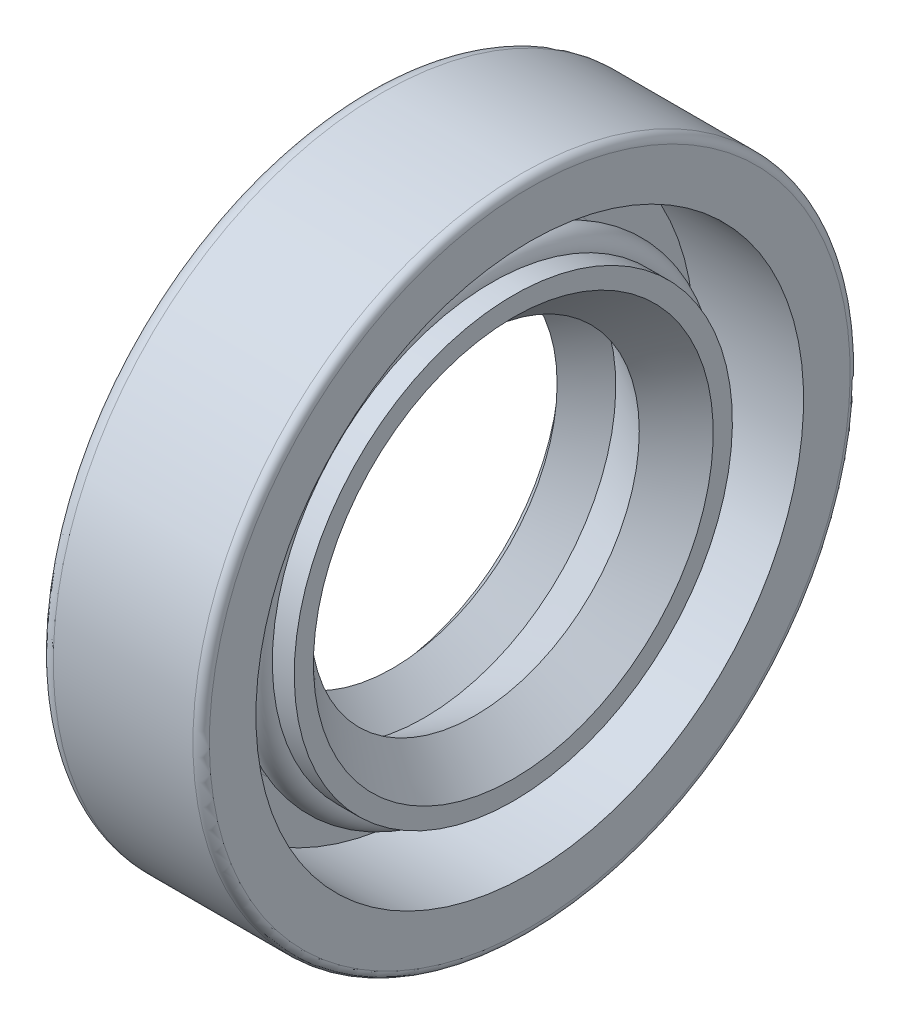
ISO-10303-21;
HEADER;
FILE_DESCRIPTION(('STEP AP214'),'2;1');
FILE_NAME('part.step','',(''),(''),'','','');
FILE_SCHEMA(('AUTOMOTIVE_DESIGN { 1 0 10303 214 1 1 1 1 }'));
ENDSEC;
DATA;
#1=APPLICATION_CONTEXT('core data for automotive mechanical design processes');
#2=APPLICATION_PROTOCOL_DEFINITION('international standard','automotive_design',2000,#1);
#3=PRODUCT_CONTEXT('',#1,'mechanical');
#4=PRODUCT('Part','Part','',(#3));
#5=PRODUCT_RELATED_PRODUCT_CATEGORY('part','',(#4));
#6=PRODUCT_DEFINITION_FORMATION('','',#4);
#7=PRODUCT_DEFINITION_CONTEXT('part definition',#1,'design');
#8=PRODUCT_DEFINITION('design','',#6,#7);
#9=PRODUCT_DEFINITION_SHAPE('','',#8);
#10=(LENGTH_UNIT() NAMED_UNIT(*) SI_UNIT(.MILLI.,.METRE.));
#11=(NAMED_UNIT(*) PLANE_ANGLE_UNIT() SI_UNIT($,.RADIAN.));
#12=(NAMED_UNIT(*) SI_UNIT($,.STERADIAN.) SOLID_ANGLE_UNIT());
#13=UNCERTAINTY_MEASURE_WITH_UNIT(LENGTH_MEASURE(1.E-05),#10,'distance_accuracy_value','');
#14=(GEOMETRIC_REPRESENTATION_CONTEXT(3) GLOBAL_UNCERTAINTY_ASSIGNED_CONTEXT((#13)) GLOBAL_UNIT_ASSIGNED_CONTEXT((#10,
#11,#12)) REPRESENTATION_CONTEXT('',''));
#15=CARTESIAN_POINT('',(0.,0.,0.));
#16=DIRECTION('',(0.,0.,1.));
#17=DIRECTION('',(1.,0.,0.));
#18=AXIS2_PLACEMENT_3D('',#15,#16,#17);
#19=CARTESIAN_POINT('',(4.23333333333333,0.,0.));
#20=DIRECTION('',(-1.,0.,0.));
#21=DIRECTION('',(0.,0.,1.));
#22=AXIS2_PLACEMENT_3D('',#19,#20,#21);
#23=TOROIDAL_SURFACE('',#22,8.46666666666667,0.635);
#24=CARTESIAN_POINT('',(4.23333333333333,0.,9.10166666666667));
#25=VERTEX_POINT('',#24);
#26=VERTEX_LOOP('',#25);
#27=FACE_BOUND('',#26,.T.);
#28=ADVANCED_FACE('F43',(#27),#23,.T.);
#29=CLOSED_SHELL('',(#28));
#30=MANIFOLD_SOLID_BREP('B2',#29);
#31=CARTESIAN_POINT('',(0.,12.065,0.));
#32=DIRECTION('',(1.,0.,0.));
#33=DIRECTION('',(0.,1.,0.));
#34=AXIS2_PLACEMENT_3D('',#31,#32,#33);
#35=PLANE('',#34);
#36=CARTESIAN_POINT('',(0.,0.,0.));
#37=DIRECTION('',(-1.,0.,0.));
#38=DIRECTION('',(0.,-1.,0.));
#39=AXIS2_PLACEMENT_3D('',#36,#37,#38);
#40=CIRCLE('',#39,10.5833333333333);
#41=CARTESIAN_POINT('',(0.,-10.5833333333333,0.));
#42=VERTEX_POINT('',#41);
#43=EDGE_CURVE('E42',#42,#42,#40,.T.);
#44=ORIENTED_EDGE('',*,*,#43,.F.);
#45=EDGE_LOOP('',(#44));
#46=FACE_BOUND('',#45,.T.);
#47=CARTESIAN_POINT('',(0.,0.,0.));
#48=DIRECTION('',(-1.,0.,0.));
#49=DIRECTION('',(0.,-1.,0.));
#50=AXIS2_PLACEMENT_3D('',#47,#48,#49);
#51=CIRCLE('',#50,12.065);
#52=CARTESIAN_POINT('',(0.,-12.065,0.));
#53=VERTEX_POINT('',#52);
#54=EDGE_CURVE('E124',#53,#53,#51,.T.);
#55=ORIENTED_EDGE('',*,*,#54,.T.);
#56=EDGE_LOOP('',(#55));
#57=FACE_BOUND('',#56,.T.);
#58=ADVANCED_FACE('F54',(#46,#57),#35,.F.);
#59=CARTESIAN_POINT('',(6.35,0.,0.));
#60=DIRECTION('',(-1.,0.,0.));
#61=DIRECTION('',(0.,-1.,0.));
#62=AXIS2_PLACEMENT_3D('',#59,#60,#61);
#63=CYLINDRICAL_SURFACE('',#62,10.5833333333333);
#64=CARTESIAN_POINT('',(0.1984375,0.,0.));
#65=DIRECTION('',(-1.,0.,0.));
#66=DIRECTION('',(0.,-1.,0.));
#67=AXIS2_PLACEMENT_3D('',#64,#65,#66);
#68=CIRCLE('',#67,10.5833333333333);
#69=CARTESIAN_POINT('',(0.1984375,-10.5833333333333,0.));
#70=VERTEX_POINT('',#69);
#71=EDGE_CURVE('E60',#70,#70,#68,.T.);
#72=ORIENTED_EDGE('',*,*,#71,.F.);
#73=EDGE_LOOP('',(#72));
#74=FACE_BOUND('',#73,.T.);
#75=ORIENTED_EDGE('',*,*,#43,.T.);
#76=EDGE_LOOP('',(#75));
#77=FACE_BOUND('',#76,.T.);
#78=ADVANCED_FACE('F245',(#74,#77),#63,.F.);
#79=CARTESIAN_POINT('',(0.1984375,10.5833333333333,0.));
#80=DIRECTION('',(1.,0.,0.));
#81=DIRECTION('',(0.,1.,0.));
#82=AXIS2_PLACEMENT_3D('',#79,#80,#81);
#83=PLANE('',#82);
#84=CARTESIAN_POINT('',(0.198437500000001,0.,0.));
#85=DIRECTION('',(-1.,0.,0.));
#86=DIRECTION('',(0.,-1.,0.));
#87=AXIS2_PLACEMENT_3D('',#84,#85,#86);
#88=CIRCLE('',#87,8.46666666666667);
#89=CARTESIAN_POINT('',(0.198437500000001,-8.46666666666667,0.));
#90=VERTEX_POINT('',#89);
#91=EDGE_CURVE('E64',#90,#90,#88,.T.);
#92=ORIENTED_EDGE('',*,*,#91,.F.);
#93=EDGE_LOOP('',(#92));
#94=FACE_BOUND('',#93,.T.);
#95=ORIENTED_EDGE('',*,*,#71,.T.);
#96=EDGE_LOOP('',(#95));
#97=FACE_BOUND('',#96,.T.);
#98=ADVANCED_FACE('F240',(#94,#97),#83,.F.);
#99=CARTESIAN_POINT('',(6.35,0.,0.));
#100=DIRECTION('',(-1.,0.,0.));
#101=DIRECTION('',(0.,-1.,0.));
#102=AXIS2_PLACEMENT_3D('',#99,#100,#101);
#103=CYLINDRICAL_SURFACE('',#102,8.46666666666667);
#104=CARTESIAN_POINT('',(0.,0.,0.));
#105=DIRECTION('',(-1.,0.,0.));
#106=DIRECTION('',(0.,-1.,0.));
#107=AXIS2_PLACEMENT_3D('',#104,#105,#106);
#108=CIRCLE('',#107,8.46666666666667);
#109=CARTESIAN_POINT('',(0.,-8.46666666666667,0.));
#110=VERTEX_POINT('',#109);
#111=EDGE_CURVE('E68',#110,#110,#108,.T.);
#112=ORIENTED_EDGE('',*,*,#111,.F.);
#113=EDGE_LOOP('',(#112));
#114=FACE_BOUND('',#113,.T.);
#115=ORIENTED_EDGE('',*,*,#91,.T.);
#116=EDGE_LOOP('',(#115));
#117=FACE_BOUND('',#116,.T.);
#118=ADVANCED_FACE('F234',(#114,#117),#103,.T.);
#119=CARTESIAN_POINT('',(0.,8.46666666666667,0.));
#120=DIRECTION('',(1.,0.,0.));
#121=DIRECTION('',(0.,1.,0.));
#122=AXIS2_PLACEMENT_3D('',#119,#120,#121);
#123=PLANE('',#122);
#124=CARTESIAN_POINT('',(0.,0.,0.));
#125=DIRECTION('',(-1.,0.,0.));
#126=DIRECTION('',(0.,-1.,0.));
#127=AXIS2_PLACEMENT_3D('',#124,#125,#126);
#128=CIRCLE('',#127,7.9375);
#129=CARTESIAN_POINT('',(0.,-7.9375,0.));
#130=VERTEX_POINT('',#129);
#131=EDGE_CURVE('E73',#130,#130,#128,.T.);
#132=ORIENTED_EDGE('',*,*,#131,.F.);
#133=EDGE_LOOP('',(#132));
#134=FACE_BOUND('',#133,.T.);
#135=ORIENTED_EDGE('',*,*,#111,.T.);
#136=EDGE_LOOP('',(#135));
#137=FACE_BOUND('',#136,.T.);
#138=ADVANCED_FACE('F228',(#134,#137),#123,.F.);
#139=CARTESIAN_POINT('',(0.,0.,0.));
#140=DIRECTION('',(-1.,0.,0.));
#141=DIRECTION('',(0.,-1.,0.));
#142=AXIS2_PLACEMENT_3D('',#139,#140,#141);
#143=CONICAL_SURFACE('',#142,7.9375,0.463647609000807);
#144=CARTESIAN_POINT('',(1.05833333333333,0.,0.));
#145=DIRECTION('',(-1.,0.,0.));
#146=DIRECTION('',(0.,-1.,0.));
#147=AXIS2_PLACEMENT_3D('',#144,#145,#146);
#148=CIRCLE('',#147,7.40833333333334);
#149=CARTESIAN_POINT('',(1.05833333333333,-7.40833333333334,0.));
#150=VERTEX_POINT('',#149);
#151=EDGE_CURVE('E76',#150,#150,#148,.T.);
#152=ORIENTED_EDGE('',*,*,#151,.F.);
#153=EDGE_LOOP('',(#152));
#154=FACE_BOUND('',#153,.T.);
#155=ORIENTED_EDGE('',*,*,#131,.T.);
#156=EDGE_LOOP('',(#155));
#157=FACE_BOUND('',#156,.T.);
#158=ADVANCED_FACE('F222',(#154,#157),#143,.F.);
#159=CARTESIAN_POINT('',(1.05833333333333,0.,0.));
#160=DIRECTION('',(1.,0.,0.));
#161=DIRECTION('',(0.,1.,0.));
#162=AXIS2_PLACEMENT_3D('',#159,#160,#161);
#163=CONICAL_SURFACE('',#162,7.40833333333334,0.719400653671796);
#164=CARTESIAN_POINT('',(0.533769729812629,0.,0.));
#165=DIRECTION('',(-1.,0.,0.));
#166=DIRECTION('',(0.,-1.,0.));
#167=AXIS2_PLACEMENT_3D('',#164,#165,#166);
#168=CIRCLE('',#167,6.94881138629771);
#169=CARTESIAN_POINT('',(0.533769729812629,-6.94881138629771,0.));
#170=VERTEX_POINT('',#169);
#171=EDGE_CURVE('E79',#170,#170,#168,.T.);
#172=ORIENTED_EDGE('',*,*,#171,.F.);
#173=EDGE_LOOP('',(#172));
#174=FACE_BOUND('',#173,.T.);
#175=ORIENTED_EDGE('',*,*,#151,.T.);
#176=EDGE_LOOP('',(#175));
#177=FACE_BOUND('',#176,.T.);
#178=ADVANCED_FACE('F216',(#174,#177),#163,.T.);
#179=CARTESIAN_POINT('',(0.533769729812629,0.,0.));
#180=DIRECTION('',(-1.,0.,0.));
#181=DIRECTION('',(0.,-1.,0.));
#182=AXIS2_PLACEMENT_3D('',#179,#180,#181);
#183=CONICAL_SURFACE('',#182,6.94881138629771,0.851395673123101);
#184=CARTESIAN_POINT('',(1.05833333333333,0.,0.));
#185=DIRECTION('',(-1.,0.,0.));
#186=DIRECTION('',(0.,-1.,0.));
#187=AXIS2_PLACEMENT_3D('',#184,#185,#186);
#188=CIRCLE('',#187,6.35);
#189=CARTESIAN_POINT('',(1.05833333333333,-6.35,0.));
#190=VERTEX_POINT('',#189);
#191=EDGE_CURVE('E82',#190,#190,#188,.T.);
#192=ORIENTED_EDGE('',*,*,#191,.F.);
#193=EDGE_LOOP('',(#192));
#194=FACE_BOUND('',#193,.T.);
#195=ORIENTED_EDGE('',*,*,#171,.T.);
#196=EDGE_LOOP('',(#195));
#197=FACE_BOUND('',#196,.T.);
#198=ADVANCED_FACE('F210',(#194,#197),#183,.F.);
#199=CARTESIAN_POINT('',(1.05833333333333,0.,0.));
#200=DIRECTION('',(1.,0.,0.));
#201=DIRECTION('',(0.,1.,0.));
#202=AXIS2_PLACEMENT_3D('',#199,#200,#201);
#203=CONICAL_SURFACE('',#202,6.35,0.719400653671796);
#204=CARTESIAN_POINT('',(2.26646528576948,0.,0.));
#205=DIRECTION('',(-1.,0.,0.));
#206=DIRECTION('',(0.,-1.,0.));
#207=AXIS2_PLACEMENT_3D('',#204,#205,#206);
#208=CIRCLE('',#207,7.40833333333334);
#209=CARTESIAN_POINT('',(2.26646528576948,-7.40833333333334,0.));
#210=VERTEX_POINT('',#209);
#211=EDGE_CURVE('E85',#210,#210,#208,.T.);
#212=ORIENTED_EDGE('',*,*,#211,.F.);
#213=EDGE_LOOP('',(#212));
#214=FACE_BOUND('',#213,.T.);
#215=ORIENTED_EDGE('',*,*,#191,.T.);
#216=EDGE_LOOP('',(#215));
#217=FACE_BOUND('',#216,.T.);
#218=ADVANCED_FACE('F204',(#214,#217),#203,.F.);
#219=CARTESIAN_POINT('',(2.26646528576948,0.,0.));
#220=DIRECTION('',(-1.,0.,0.));
#221=DIRECTION('',(0.,-1.,0.));
#222=AXIS2_PLACEMENT_3D('',#219,#220,#221);
#223=CONICAL_SURFACE('',#222,7.40833333333334,0.493645926133372);
#224=CARTESIAN_POINT('',(4.23333333333333,0.,0.));
#225=DIRECTION('',(-1.,0.,0.));
#226=DIRECTION('',(0.,-1.,0.));
#227=AXIS2_PLACEMENT_3D('',#224,#225,#226);
#228=CIRCLE('',#227,6.35);
#229=CARTESIAN_POINT('',(4.23333333333333,-6.35,0.));
#230=VERTEX_POINT('',#229);
#231=EDGE_CURVE('E88',#230,#230,#228,.T.);
#232=ORIENTED_EDGE('',*,*,#231,.F.);
#233=EDGE_LOOP('',(#232));
#234=FACE_BOUND('',#233,.T.);
#235=ORIENTED_EDGE('',*,*,#211,.T.);
#236=EDGE_LOOP('',(#235));
#237=FACE_BOUND('',#236,.T.);
#238=ADVANCED_FACE('F198',(#234,#237),#223,.F.);
#239=CARTESIAN_POINT('',(4.23333333333333,0.,0.));
#240=DIRECTION('',(1.,0.,0.));
#241=DIRECTION('',(0.,1.,0.));
#242=AXIS2_PLACEMENT_3D('',#239,#240,#241);
#243=CONICAL_SURFACE('',#242,6.35,0.748378047523382);
#244=CARTESIAN_POINT('',(5.71500000000001,0.,0.));
#245=DIRECTION('',(-1.,0.,0.));
#246=DIRECTION('',(0.,-1.,0.));
#247=AXIS2_PLACEMENT_3D('',#244,#245,#246);
#248=CIRCLE('',#247,7.72583333333297);
#249=CARTESIAN_POINT('',(5.71500000000001,-7.72583333333297,0.));
#250=VERTEX_POINT('',#249);
#251=EDGE_CURVE('E91',#250,#250,#248,.T.);
#252=ORIENTED_EDGE('',*,*,#251,.F.);
#253=EDGE_LOOP('',(#252));
#254=FACE_BOUND('',#253,.T.);
#255=ORIENTED_EDGE('',*,*,#231,.T.);
#256=EDGE_LOOP('',(#255));
#257=FACE_BOUND('',#256,.T.);
#258=ADVANCED_FACE('F192',(#254,#257),#243,.F.);
#259=CARTESIAN_POINT('',(5.71500000000001,7.72583333333297,0.));
#260=DIRECTION('',(-1.,0.,0.));
#261=DIRECTION('',(0.,-1.,0.));
#262=AXIS2_PLACEMENT_3D('',#259,#260,#261);
#263=PLANE('',#262);
#264=CARTESIAN_POINT('',(5.71500000000001,0.,0.));
#265=DIRECTION('',(-1.,0.,0.));
#266=DIRECTION('',(0.,-1.,0.));
#267=AXIS2_PLACEMENT_3D('',#264,#265,#266);
#268=CIRCLE('',#267,8.46666666666667);
#269=CARTESIAN_POINT('',(5.71500000000001,-8.46666666666667,0.));
#270=VERTEX_POINT('',#269);
#271=EDGE_CURVE('E94',#270,#270,#268,.T.);
#272=ORIENTED_EDGE('',*,*,#271,.F.);
#273=EDGE_LOOP('',(#272));
#274=FACE_BOUND('',#273,.T.);
#275=ORIENTED_EDGE('',*,*,#251,.T.);
#276=EDGE_LOOP('',(#275));
#277=FACE_BOUND('',#276,.T.);
#278=ADVANCED_FACE('F186',(#274,#277),#263,.F.);
#279=CARTESIAN_POINT('',(6.35,0.,0.));
#280=DIRECTION('',(-1.,0.,0.));
#281=DIRECTION('',(0.,-1.,0.));
#282=AXIS2_PLACEMENT_3D('',#279,#280,#281);
#283=CYLINDRICAL_SURFACE('',#282,8.46666666666667);
#284=CARTESIAN_POINT('',(4.86833333333333,0.,0.));
#285=DIRECTION('',(-1.,0.,0.));
#286=DIRECTION('',(0.,-1.,0.));
#287=AXIS2_PLACEMENT_3D('',#284,#285,#286);
#288=CIRCLE('',#287,8.46666666666667);
#289=CARTESIAN_POINT('',(4.86833333333333,-8.46666666666667,0.));
#290=VERTEX_POINT('',#289);
#291=EDGE_CURVE('E97',#290,#290,#288,.T.);
#292=ORIENTED_EDGE('',*,*,#291,.F.);
#293=EDGE_LOOP('',(#292));
#294=FACE_BOUND('',#293,.T.);
#295=ORIENTED_EDGE('',*,*,#271,.T.);
#296=EDGE_LOOP('',(#295));
#297=FACE_BOUND('',#296,.T.);
#298=ADVANCED_FACE('F180',(#294,#297),#283,.T.);
#299=CARTESIAN_POINT('',(4.23333333333333,0.,0.));
#300=DIRECTION('',(-1.,0.,0.));
#301=DIRECTION('',(0.,-1.,0.));
#302=AXIS2_PLACEMENT_3D('',#299,#300,#301);
#303=TOROIDAL_SURFACE('',#302,8.46666666666667,0.634999999999995);
#304=CARTESIAN_POINT('',(3.59833333333334,0.,0.));
#305=DIRECTION('',(-1.,0.,0.));
#306=DIRECTION('',(0.,-1.,0.));
#307=AXIS2_PLACEMENT_3D('',#304,#305,#306);
#308=CIRCLE('',#307,8.46666666666667);
#309=CARTESIAN_POINT('',(3.59833333333334,-8.46666666666667,0.));
#310=VERTEX_POINT('',#309);
#311=EDGE_CURVE('E100',#310,#310,#308,.T.);
#312=ORIENTED_EDGE('',*,*,#311,.F.);
#313=EDGE_LOOP('',(#312));
#314=FACE_BOUND('',#313,.T.);
#315=ORIENTED_EDGE('',*,*,#291,.T.);
#316=EDGE_LOOP('',(#315));
#317=FACE_BOUND('',#316,.T.);
#318=ADVANCED_FACE('F174',(#314,#317),#303,.F.);
#319=CARTESIAN_POINT('',(6.35,0.,0.));
#320=DIRECTION('',(-1.,0.,0.));
#321=DIRECTION('',(0.,-1.,0.));
#322=AXIS2_PLACEMENT_3D('',#319,#320,#321);
#323=CYLINDRICAL_SURFACE('',#322,8.46666666666667);
#324=CARTESIAN_POINT('',(2.43416666666667,0.,0.));
#325=DIRECTION('',(-1.,0.,0.));
#326=DIRECTION('',(0.,-1.,0.));
#327=AXIS2_PLACEMENT_3D('',#324,#325,#326);
#328=CIRCLE('',#327,8.46666666666667);
#329=CARTESIAN_POINT('',(2.43416666666667,-8.46666666666667,0.));
#330=VERTEX_POINT('',#329);
#331=EDGE_CURVE('E103',#330,#330,#328,.T.);
#332=ORIENTED_EDGE('',*,*,#331,.F.);
#333=EDGE_LOOP('',(#332));
#334=FACE_BOUND('',#333,.T.);
#335=ORIENTED_EDGE('',*,*,#311,.T.);
#336=EDGE_LOOP('',(#335));
#337=FACE_BOUND('',#336,.T.);
#338=ADVANCED_FACE('F168',(#334,#337),#323,.T.);
#339=CARTESIAN_POINT('',(2.43416666666667,0.,0.));
#340=DIRECTION('',(-1.,0.,0.));
#341=DIRECTION('',(0.,-1.,0.));
#342=AXIS2_PLACEMENT_3D('',#339,#340,#341);
#343=TOROIDAL_SURFACE('',#342,8.78416666666667,0.317500000000002);
#344=CARTESIAN_POINT('',(2.11666666666667,0.,0.));
#345=DIRECTION('',(-1.,0.,0.));
#346=DIRECTION('',(0.,-1.,0.));
#347=AXIS2_PLACEMENT_3D('',#344,#345,#346);
#348=CIRCLE('',#347,8.78416666666667);
#349=CARTESIAN_POINT('',(2.11666666666667,-8.78416666666667,0.));
#350=VERTEX_POINT('',#349);
#351=EDGE_CURVE('E106',#350,#350,#348,.T.);
#352=ORIENTED_EDGE('',*,*,#351,.F.);
#353=EDGE_LOOP('',(#352));
#354=FACE_BOUND('',#353,.T.);
#355=ORIENTED_EDGE('',*,*,#331,.T.);
#356=EDGE_LOOP('',(#355));
#357=FACE_BOUND('',#356,.T.);
#358=ADVANCED_FACE('F162',(#354,#357),#343,.F.);
#359=CARTESIAN_POINT('',(2.11666666666667,8.78416666666667,0.));
#360=DIRECTION('',(-1.,0.,0.));
#361=DIRECTION('',(0.,-1.,0.));
#362=AXIS2_PLACEMENT_3D('',#359,#360,#361);
#363=PLANE('',#362);
#364=CARTESIAN_POINT('',(2.11666666666667,0.,0.));
#365=DIRECTION('',(-1.,0.,0.));
#366=DIRECTION('',(0.,-1.,0.));
#367=AXIS2_PLACEMENT_3D('',#364,#365,#366);
#368=CIRCLE('',#367,10.5833333333333);
#369=CARTESIAN_POINT('',(2.11666666666667,-10.5833333333333,0.));
#370=VERTEX_POINT('',#369);
#371=EDGE_CURVE('E109',#370,#370,#368,.T.);
#372=ORIENTED_EDGE('',*,*,#371,.F.);
#373=EDGE_LOOP('',(#372));
#374=FACE_BOUND('',#373,.T.);
#375=ORIENTED_EDGE('',*,*,#351,.T.);
#376=EDGE_LOOP('',(#375));
#377=FACE_BOUND('',#376,.T.);
#378=ADVANCED_FACE('F156',(#374,#377),#363,.F.);
#379=CARTESIAN_POINT('',(6.35,0.,0.));
#380=DIRECTION('',(-1.,0.,0.));
#381=DIRECTION('',(0.,-1.,0.));
#382=AXIS2_PLACEMENT_3D('',#379,#380,#381);
#383=CYLINDRICAL_SURFACE('',#382,10.5833333333333);
#384=CARTESIAN_POINT('',(6.35,0.,0.));
#385=DIRECTION('',(-1.,0.,0.));
#386=DIRECTION('',(0.,-1.,0.));
#387=AXIS2_PLACEMENT_3D('',#384,#385,#386);
#388=CIRCLE('',#387,10.5833333333333);
#389=CARTESIAN_POINT('',(6.35,-10.5833333333333,0.));
#390=VERTEX_POINT('',#389);
#391=EDGE_CURVE('E112',#390,#390,#388,.T.);
#392=ORIENTED_EDGE('',*,*,#391,.F.);
#393=EDGE_LOOP('',(#392));
#394=FACE_BOUND('',#393,.T.);
#395=ORIENTED_EDGE('',*,*,#371,.T.);
#396=EDGE_LOOP('',(#395));
#397=FACE_BOUND('',#396,.T.);
#398=ADVANCED_FACE('F150',(#394,#397),#383,.F.);
#399=CARTESIAN_POINT('',(6.35,10.5833333333333,0.));
#400=DIRECTION('',(-1.,0.,0.));
#401=DIRECTION('',(0.,-1.,0.));
#402=AXIS2_PLACEMENT_3D('',#399,#400,#401);
#403=PLANE('',#402);
#404=CARTESIAN_POINT('',(6.35,0.,0.));
#405=DIRECTION('',(-1.,0.,0.));
#406=DIRECTION('',(0.,-1.,0.));
#407=AXIS2_PLACEMENT_3D('',#404,#405,#406);
#408=CIRCLE('',#407,12.3825);
#409=CARTESIAN_POINT('',(6.35,-12.3825,0.));
#410=VERTEX_POINT('',#409);
#411=EDGE_CURVE('E115',#410,#410,#408,.T.);
#412=ORIENTED_EDGE('',*,*,#411,.F.);
#413=EDGE_LOOP('',(#412));
#414=FACE_BOUND('',#413,.T.);
#415=ORIENTED_EDGE('',*,*,#391,.T.);
#416=EDGE_LOOP('',(#415));
#417=FACE_BOUND('',#416,.T.);
#418=ADVANCED_FACE('F144',(#414,#417),#403,.F.);
#419=CARTESIAN_POINT('',(6.0325,0.,0.));
#420=DIRECTION('',(-1.,0.,0.));
#421=DIRECTION('',(0.,-1.,0.));
#422=AXIS2_PLACEMENT_3D('',#419,#420,#421);
#423=TOROIDAL_SURFACE('',#422,12.3825,0.317499999999993);
#424=CARTESIAN_POINT('',(6.0325,0.,0.));
#425=DIRECTION('',(-1.,0.,0.));
#426=DIRECTION('',(0.,-1.,0.));
#427=AXIS2_PLACEMENT_3D('',#424,#425,#426);
#428=CIRCLE('',#427,12.7);
#429=CARTESIAN_POINT('',(6.0325,-12.7,0.));
#430=VERTEX_POINT('',#429);
#431=EDGE_CURVE('E118',#430,#430,#428,.T.);
#432=ORIENTED_EDGE('',*,*,#431,.F.);
#433=EDGE_LOOP('',(#432));
#434=FACE_BOUND('',#433,.T.);
#435=ORIENTED_EDGE('',*,*,#411,.T.);
#436=EDGE_LOOP('',(#435));
#437=FACE_BOUND('',#436,.T.);
#438=ADVANCED_FACE('F138',(#434,#437),#423,.T.);
#439=CARTESIAN_POINT('',(6.35,0.,0.));
#440=DIRECTION('',(-1.,0.,0.));
#441=DIRECTION('',(0.,-1.,0.));
#442=AXIS2_PLACEMENT_3D('',#439,#440,#441);
#443=CYLINDRICAL_SURFACE('',#442,12.7);
#444=CARTESIAN_POINT('',(0.634999999999989,0.,0.));
#445=DIRECTION('',(-1.,0.,0.));
#446=DIRECTION('',(0.,-1.,0.));
#447=AXIS2_PLACEMENT_3D('',#444,#445,#446);
#448=CIRCLE('',#447,12.7);
#449=CARTESIAN_POINT('',(0.634999999999989,-12.7,0.));
#450=VERTEX_POINT('',#449);
#451=EDGE_CURVE('E121',#450,#450,#448,.T.);
#452=ORIENTED_EDGE('',*,*,#451,.F.);
#453=EDGE_LOOP('',(#452));
#454=FACE_BOUND('',#453,.T.);
#455=ORIENTED_EDGE('',*,*,#431,.T.);
#456=EDGE_LOOP('',(#455));
#457=FACE_BOUND('',#456,.T.);
#458=ADVANCED_FACE('F132',(#454,#457),#443,.T.);
#459=CARTESIAN_POINT('',(0.634999999999989,0.,0.));
#460=DIRECTION('',(-1.,0.,0.));
#461=DIRECTION('',(0.,-1.,0.));
#462=AXIS2_PLACEMENT_3D('',#459,#460,#461);
#463=TOROIDAL_SURFACE('',#462,12.065,0.634999999999994);
#464=ORIENTED_EDGE('',*,*,#54,.F.);
#465=EDGE_LOOP('',(#464));
#466=FACE_BOUND('',#465,.T.);
#467=ORIENTED_EDGE('',*,*,#451,.T.);
#468=EDGE_LOOP('',(#467));
#469=FACE_BOUND('',#468,.T.);
#470=ADVANCED_FACE('F129',(#466,#469),#463,.T.);
#471=CLOSED_SHELL('',(#58,#78,#98,#118,#138,#158,#178,#198,#218,#238,#258,#278,#298,#318,#338,
#358,#378,#398,#418,#438,#458,#470));
#472=MANIFOLD_SOLID_BREP('B6',#471);
#473=ADVANCED_BREP_SHAPE_REPRESENTATION('',(#18,#30,#472),#14);
#474=SHAPE_DEFINITION_REPRESENTATION(#9,#473);
ENDSEC;
END-ISO-10303-21;
